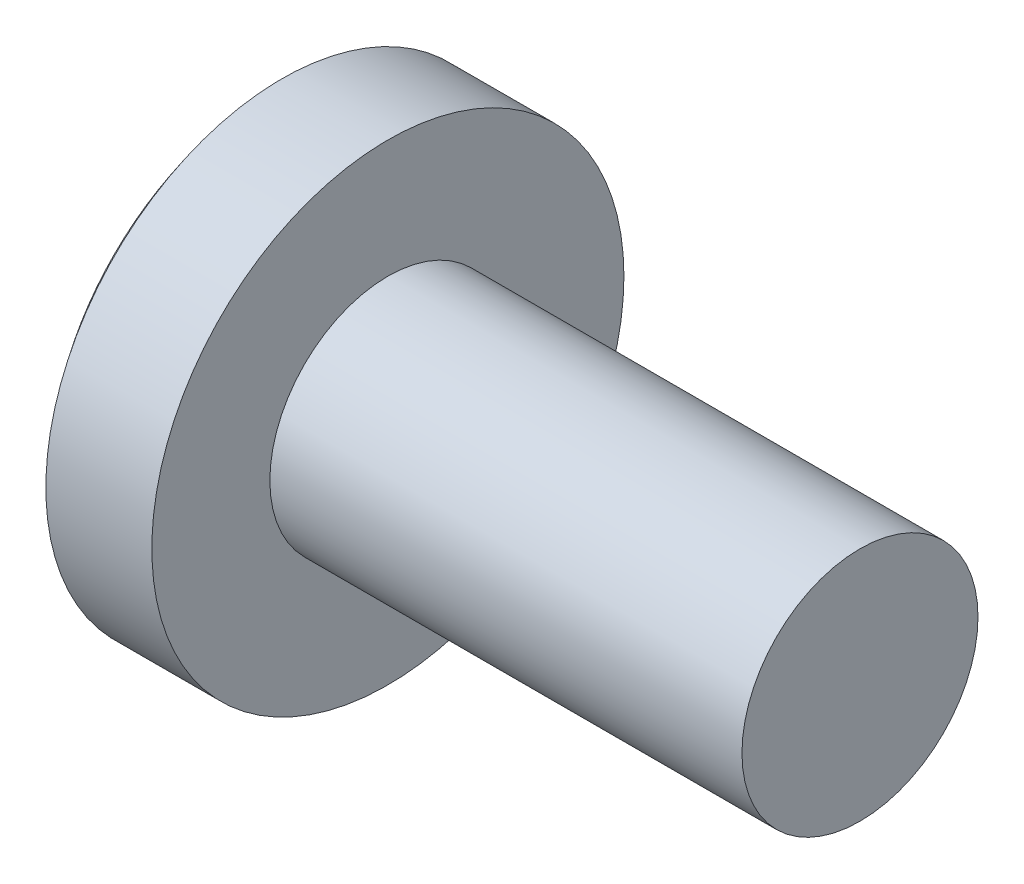
ISO-10303-21;
HEADER;
FILE_DESCRIPTION(('STEP AP214'),'2;1');
FILE_NAME('part.step','',(''),(''),'','','');
FILE_SCHEMA(('AUTOMOTIVE_DESIGN { 1 0 10303 214 1 1 1 1 }'));
ENDSEC;
DATA;
#1=APPLICATION_CONTEXT('core data for automotive mechanical design processes');
#2=APPLICATION_PROTOCOL_DEFINITION('international standard','automotive_design',2000,#1);
#3=PRODUCT_CONTEXT('',#1,'mechanical');
#4=PRODUCT('Part','Part','',(#3));
#5=PRODUCT_RELATED_PRODUCT_CATEGORY('part','',(#4));
#6=PRODUCT_DEFINITION_FORMATION('','',#4);
#7=PRODUCT_DEFINITION_CONTEXT('part definition',#1,'design');
#8=PRODUCT_DEFINITION('design','',#6,#7);
#9=PRODUCT_DEFINITION_SHAPE('','',#8);
#10=(LENGTH_UNIT() NAMED_UNIT(*) SI_UNIT(.MILLI.,.METRE.));
#11=(NAMED_UNIT(*) PLANE_ANGLE_UNIT() SI_UNIT($,.RADIAN.));
#12=(NAMED_UNIT(*) SI_UNIT($,.STERADIAN.) SOLID_ANGLE_UNIT());
#13=UNCERTAINTY_MEASURE_WITH_UNIT(LENGTH_MEASURE(1.E-05),#10,'distance_accuracy_value','');
#14=(GEOMETRIC_REPRESENTATION_CONTEXT(3) GLOBAL_UNCERTAINTY_ASSIGNED_CONTEXT((#13)) GLOBAL_UNIT_ASSIGNED_CONTEXT((#10,
#11,#12)) REPRESENTATION_CONTEXT('',''));
#15=CARTESIAN_POINT('',(0.,0.,0.));
#16=DIRECTION('',(0.,0.,1.));
#17=DIRECTION('',(1.,0.,0.));
#18=AXIS2_PLACEMENT_3D('',#15,#16,#17);
#19=CARTESIAN_POINT('',(3.2,0.,0.));
#20=DIRECTION('',(1.,0.,0.));
#21=DIRECTION('',(0.,1.,0.));
#22=AXIS2_PLACEMENT_3D('',#19,#20,#21);
#23=SPHERICAL_SURFACE('',#22,3.2);
#24=CARTESIAN_POINT('',(0.702000800640641,0.,0.));
#25=DIRECTION('',(1.,0.,0.));
#26=DIRECTION('',(0.,0.,-1.));
#27=AXIS2_PLACEMENT_3D('',#24,#25,#26);
#28=CIRCLE('',#27,2.);
#29=CARTESIAN_POINT('',(0.702000800640641,0.,-2.));
#30=VERTEX_POINT('',#29);
#31=EDGE_CURVE('E207',#30,#30,#28,.T.);
#32=ORIENTED_EDGE('',*,*,#31,.F.);
#33=EDGE_LOOP('',(#32));
#34=FACE_BOUND('',#33,.T.);
#35=CARTESIAN_POINT('',(3.2,-0.19,0.));
#36=DIRECTION('',(0.,1.,0.));
#37=DIRECTION('',(0.,0.,1.));
#38=AXIS2_PLACEMENT_3D('',#35,#36,#37);
#39=CIRCLE('',#38,3.19435439486604);
#40=CARTESIAN_POINT('',(0.128116518841083,-0.19,0.876031893359463));
#41=VERTEX_POINT('',#40);
#42=CARTESIAN_POINT('',(0.0434512517624576,-0.19,0.49));
#43=VERTEX_POINT('',#42);
#44=EDGE_CURVE('E141',#41,#43,#39,.F.);
#45=ORIENTED_EDGE('',*,*,#44,.T.);
#46=CARTESIAN_POINT('',(0.0434512517624571,-0.19,0.49));
#47=CARTESIAN_POINT('',(0.0408738773929442,-0.189985118490982,0.473411368352518));
#48=CARTESIAN_POINT('',(0.0385122737731477,-0.191375280547119,0.45678774580514));
#49=CARTESIAN_POINT('',(0.0342793774917009,-0.196894192604607,0.423939980878307));
#50=CARTESIAN_POINT('',(0.032408018098608,-0.201022569613025,0.407715784402144));
#51=CARTESIAN_POINT('',(0.0292120609216641,-0.2119518671846,0.376115889679846));
#52=CARTESIAN_POINT('',(0.0278880075495782,-0.218755435732716,0.360741049401918));
#53=CARTESIAN_POINT('',(0.0258300216333508,-0.234850871954501,0.331318538531042));
#54=CARTESIAN_POINT('',(0.0250958387239786,-0.244141681706182,0.317270307107504));
#55=CARTESIAN_POINT('',(0.0242453397312426,-0.264820786877322,0.291079740811089));
#56=CARTESIAN_POINT('',(0.0241213644300021,-0.276181215319777,0.27891564613864));
#57=CARTESIAN_POINT('',(0.0244743849819802,-0.300751739444164,0.256633055026912));
#58=CARTESIAN_POINT('',(0.0249514532038782,-0.313962057691943,0.246514805087926));
#59=CARTESIAN_POINT('',(0.0264873092406806,-0.341764748147378,0.22866155902565));
#60=CARTESIAN_POINT('',(0.0275427361860064,-0.356348736233031,0.220913192921297));
#61=CARTESIAN_POINT('',(0.0302016331156974,-0.386546091629585,0.207923367225205));
#62=CARTESIAN_POINT('',(0.0318049788587377,-0.402159224933208,0.202681339963669));
#63=CARTESIAN_POINT('',(0.0350324297399582,-0.429857047162115,0.195839033890913));
#64=CARTESIAN_POINT('',(0.036544485982116,-0.441812973684979,0.193648149789925));
#65=CARTESIAN_POINT('',(0.0398172259395469,-0.465850838778572,0.190728248289838));
#66=CARTESIAN_POINT('',(0.0415775491224674,-0.47793257149748,0.189997133951024));
#67=CARTESIAN_POINT('',(0.0434512517624571,-0.49,0.19));
#68=B_SPLINE_CURVE_WITH_KNOTS('',3,(#46,#47,#48,#49,#50,#51,#52,#53,#54,#55,#56,#57,#58,#59,#60,
#61,#62,#63,#64,#65,#66,#67),.UNSPECIFIED.,.F.,.F.,(4,2,2,2,2,2,2,2,2,2,4),(0.,
0.0503064187517198,0.100605986293286,0.150955467701085,0.201283567416481,0.250978317771728,
0.300679052198084,0.350093989724499,0.399497729773931,0.436157176931991,0.472763925288841),.UNSPECIFIED.);
#69=CARTESIAN_POINT('',(0.0434512517624576,-0.49,0.19));
#70=VERTEX_POINT('',#69);
#71=EDGE_CURVE('E126',#43,#70,#68,.T.);
#72=ORIENTED_EDGE('',*,*,#71,.T.);
#73=CARTESIAN_POINT('',(3.2,0.,0.19));
#74=DIRECTION('',(0.,0.,-1.));
#75=DIRECTION('',(0.,1.,0.));
#76=AXIS2_PLACEMENT_3D('',#73,#74,#75);
#77=CIRCLE('',#76,3.19435439486604);
#78=CARTESIAN_POINT('',(0.128116518841083,-0.876031893359463,0.19));
#79=VERTEX_POINT('',#78);
#80=EDGE_CURVE('E150',#70,#79,#77,.F.);
#81=ORIENTED_EDGE('',*,*,#80,.T.);
#82=CARTESIAN_POINT('',(2.81136206679761,0.673140646055104,0.));
#83=DIRECTION('',(-0.5,0.866025403784438,0.));
#84=DIRECTION('',(-0.866025403784438,-0.5,0.));
#85=AXIS2_PLACEMENT_3D('',#82,#83,#84);
#86=CIRCLE('',#85,3.10416530286399);
#87=CARTESIAN_POINT('',(0.128116518841083,-0.876031893359463,-0.19));
#88=VERTEX_POINT('',#87);
#89=EDGE_CURVE('E153',#79,#88,#86,.F.);
#90=ORIENTED_EDGE('',*,*,#89,.T.);
#91=CARTESIAN_POINT('',(3.2,0.,-0.19));
#92=DIRECTION('',(0.,0.,1.));
#93=DIRECTION('',(1.,0.,0.));
#94=AXIS2_PLACEMENT_3D('',#91,#92,#93);
#95=CIRCLE('',#94,3.19435439486604);
#96=CARTESIAN_POINT('',(0.0434512517624576,-0.49,-0.19));
#97=VERTEX_POINT('',#96);
#98=EDGE_CURVE('E160',#88,#97,#95,.F.);
#99=ORIENTED_EDGE('',*,*,#98,.T.);
#100=CARTESIAN_POINT('',(0.0434512517624571,-0.49,-0.19));
#101=CARTESIAN_POINT('',(0.0408738773929448,-0.473411368352518,-0.189985118490982));
#102=CARTESIAN_POINT('',(0.0385122737731485,-0.45678774580514,-0.191375280547119));
#103=CARTESIAN_POINT('',(0.0342793774917017,-0.423939980878307,-0.196894192604607));
#104=CARTESIAN_POINT('',(0.0324080180986087,-0.407715784402144,-0.201022569613025));
#105=CARTESIAN_POINT('',(0.0292120609216642,-0.376115889679846,-0.2119518671846));
#106=CARTESIAN_POINT('',(0.027888007549578,-0.360741049401919,-0.218755435732716));
#107=CARTESIAN_POINT('',(0.0258300216333505,-0.331318538531043,-0.234850871954501));
#108=CARTESIAN_POINT('',(0.0250958387239786,-0.317270307107504,-0.244141681706183));
#109=CARTESIAN_POINT('',(0.0242453397312427,-0.291079740811089,-0.264820786877322));
#110=CARTESIAN_POINT('',(0.0241213644300021,-0.27891564613864,-0.276181215319776));
#111=CARTESIAN_POINT('',(0.0244743849819801,-0.256633055026912,-0.300751739444164));
#112=CARTESIAN_POINT('',(0.0249514532038781,-0.246514805087926,-0.313962057691943));
#113=CARTESIAN_POINT('',(0.0264873092406806,-0.22866155902565,-0.341764748147379));
#114=CARTESIAN_POINT('',(0.0275427361860063,-0.220913192921297,-0.356348736233031));
#115=CARTESIAN_POINT('',(0.0302016331156974,-0.207923367225205,-0.386546091629585));
#116=CARTESIAN_POINT('',(0.0318049788587377,-0.20268133996367,-0.402159224933209));
#117=CARTESIAN_POINT('',(0.0350324297399583,-0.195839033890913,-0.429857047162115));
#118=CARTESIAN_POINT('',(0.0365444859821161,-0.193648149789925,-0.441812973684979));
#119=CARTESIAN_POINT('',(0.0398172259395469,-0.190728248289838,-0.465850838778572));
#120=CARTESIAN_POINT('',(0.0415775491224674,-0.189997133951024,-0.47793257149748));
#121=CARTESIAN_POINT('',(0.0434512517624571,-0.19,-0.49));
#122=B_SPLINE_CURVE_WITH_KNOTS('',3,(#100,#101,#102,#103,#104,#105,#106,#107,#108,#109,#110,
#111,#112,#113,#114,#115,#116,#117,#118,#119,#120,#121),.UNSPECIFIED.,.F.,.F.,(4,2,2,2,2,2,2,2,
2,2,4),(0.,0.0503064187517195,0.100605986293286,0.150955467701084,0.20128356741648,
0.250978317771727,0.300679052198084,0.350093989724499,0.399497729773931,0.43615717693199,
0.472763925288841),.UNSPECIFIED.);
#123=CARTESIAN_POINT('',(0.0434512517624576,-0.19,-0.49));
#124=VERTEX_POINT('',#123);
#125=EDGE_CURVE('E137',#97,#124,#122,.T.);
#126=ORIENTED_EDGE('',*,*,#125,.T.);
#127=CARTESIAN_POINT('',(3.2,-0.19,0.));
#128=DIRECTION('',(0.,1.,0.));
#129=DIRECTION('',(0.,0.,1.));
#130=AXIS2_PLACEMENT_3D('',#127,#128,#129);
#131=CIRCLE('',#130,3.19435439486604);
#132=CARTESIAN_POINT('',(0.128116518841083,-0.19,-0.876031893359463));
#133=VERTEX_POINT('',#132);
#134=EDGE_CURVE('E158',#124,#133,#131,.F.);
#135=ORIENTED_EDGE('',*,*,#134,.T.);
#136=CARTESIAN_POINT('',(2.81136206679761,0.,0.673140646055104));
#137=DIRECTION('',(-0.5,0.,0.866025403784438));
#138=DIRECTION('',(0.866025403784438,0.,0.5));
#139=AXIS2_PLACEMENT_3D('',#136,#137,#138);
#140=CIRCLE('',#139,3.10416530286399);
#141=CARTESIAN_POINT('',(0.128116518841083,0.19,-0.876031893359463));
#142=VERTEX_POINT('',#141);
#143=EDGE_CURVE('E161',#133,#142,#140,.F.);
#144=ORIENTED_EDGE('',*,*,#143,.T.);
#145=CARTESIAN_POINT('',(3.2,0.19,0.));
#146=DIRECTION('',(0.,-1.,0.));
#147=DIRECTION('',(0.,0.,-1.));
#148=AXIS2_PLACEMENT_3D('',#145,#146,#147);
#149=CIRCLE('',#148,3.19435439486604);
#150=CARTESIAN_POINT('',(0.0434512517624576,0.19,-0.49));
#151=VERTEX_POINT('',#150);
#152=EDGE_CURVE('E162',#142,#151,#149,.F.);
#153=ORIENTED_EDGE('',*,*,#152,.T.);
#154=CARTESIAN_POINT('',(0.0434512517624571,0.19,-0.49));
#155=CARTESIAN_POINT('',(0.0408738773929445,0.189985118490982,-0.473411368352518));
#156=CARTESIAN_POINT('',(0.0385122737731481,0.191375280547119,-0.45678774580514));
#157=CARTESIAN_POINT('',(0.0342793774917014,0.196894192604607,-0.423939980878307));
#158=CARTESIAN_POINT('',(0.0324080180986086,0.201022569613025,-0.407715784402144));
#159=CARTESIAN_POINT('',(0.0292120609216644,0.2119518671846,-0.376115889679846));
#160=CARTESIAN_POINT('',(0.0278880075495783,0.218755435732716,-0.360741049401919));
#161=CARTESIAN_POINT('',(0.0258300216333509,0.234850871954501,-0.331318538531043));
#162=CARTESIAN_POINT('',(0.0250958387239788,0.244141681706183,-0.317270307107504));
#163=CARTESIAN_POINT('',(0.0242453397312424,0.264820786877322,-0.291079740811089));
#164=CARTESIAN_POINT('',(0.0241213644300013,0.276181215319776,-0.27891564613864));
#165=CARTESIAN_POINT('',(0.0244743849819795,0.300751739444163,-0.256633055026913));
#166=CARTESIAN_POINT('',(0.0249514532038783,0.313962057691943,-0.246514805087926));
#167=CARTESIAN_POINT('',(0.0264873092406812,0.341764748147378,-0.22866155902565));
#168=CARTESIAN_POINT('',(0.0275427361860068,0.356348736233031,-0.220913192921297));
#169=CARTESIAN_POINT('',(0.0302016331156974,0.386546091629584,-0.207923367225206));
#170=CARTESIAN_POINT('',(0.0318049788587374,0.402159224933208,-0.202681339963671));
#171=CARTESIAN_POINT('',(0.0350324297399584,0.429857047162115,-0.195839033890914));
#172=CARTESIAN_POINT('',(0.0365444859821166,0.441812973684979,-0.193648149789926));
#173=CARTESIAN_POINT('',(0.0398172259395477,0.465850838778572,-0.190728248289838));
#174=CARTESIAN_POINT('',(0.0415775491224682,0.47793257149748,-0.189997133951023));
#175=CARTESIAN_POINT('',(0.0434512517624571,0.49,-0.19));
#176=B_SPLINE_CURVE_WITH_KNOTS('',3,(#154,#155,#156,#157,#158,#159,#160,#161,#162,#163,#164,
#165,#166,#167,#168,#169,#170,#171,#172,#173,#174,#175),.UNSPECIFIED.,.F.,.F.,(4,2,2,2,2,2,2,2,
2,2,4),(0.,0.0503064187517195,0.100605986293286,0.150955467701084,0.20128356741648,
0.250978317771727,0.300679052198084,0.350093989724498,0.39949772977393,0.43615717693199,
0.472763925288841),.UNSPECIFIED.);
#177=CARTESIAN_POINT('',(0.0434512517624576,0.49,-0.19));
#178=VERTEX_POINT('',#177);
#179=EDGE_CURVE('E144',#151,#178,#176,.T.);
#180=ORIENTED_EDGE('',*,*,#179,.T.);
#181=CARTESIAN_POINT('',(3.2,0.,-0.19));
#182=DIRECTION('',(0.,0.,1.));
#183=DIRECTION('',(1.,0.,0.));
#184=AXIS2_PLACEMENT_3D('',#181,#182,#183);
#185=CIRCLE('',#184,3.19435439486604);
#186=CARTESIAN_POINT('',(0.128116518841082,0.876031893359464,-0.19));
#187=VERTEX_POINT('',#186);
#188=EDGE_CURVE('E165',#178,#187,#185,.F.);
#189=ORIENTED_EDGE('',*,*,#188,.T.);
#190=CARTESIAN_POINT('',(2.81136206679761,-0.673140646055104,0.));
#191=DIRECTION('',(-0.5,-0.866025403784438,0.));
#192=DIRECTION('',(0.866025403784438,-0.5,0.));
#193=AXIS2_PLACEMENT_3D('',#190,#191,#192);
#194=CIRCLE('',#193,3.10416530286399);
#195=CARTESIAN_POINT('',(0.128116518841082,0.876031893359464,0.19));
#196=VERTEX_POINT('',#195);
#197=EDGE_CURVE('E191',#187,#196,#194,.F.);
#198=ORIENTED_EDGE('',*,*,#197,.T.);
#199=CARTESIAN_POINT('',(3.2,0.,0.19));
#200=DIRECTION('',(0.,0.,-1.));
#201=DIRECTION('',(0.,1.,0.));
#202=AXIS2_PLACEMENT_3D('',#199,#200,#201);
#203=CIRCLE('',#202,3.19435439486604);
#204=CARTESIAN_POINT('',(0.0434512517624576,0.49,0.19));
#205=VERTEX_POINT('',#204);
#206=EDGE_CURVE('E194',#196,#205,#203,.F.);
#207=ORIENTED_EDGE('',*,*,#206,.T.);
#208=CARTESIAN_POINT('',(0.0434512517624571,0.49,0.19));
#209=CARTESIAN_POINT('',(0.0408738773929445,0.473411368352519,0.189985118490982));
#210=CARTESIAN_POINT('',(0.0385122737731482,0.45678774580514,0.191375280547119));
#211=CARTESIAN_POINT('',(0.0342793774917014,0.423939980878307,0.196894192604606));
#212=CARTESIAN_POINT('',(0.0324080180986085,0.407715784402144,0.201022569613024));
#213=CARTESIAN_POINT('',(0.0292120609216644,0.376115889679846,0.211951867184599));
#214=CARTESIAN_POINT('',(0.0278880075495784,0.360741049401919,0.218755435732716));
#215=CARTESIAN_POINT('',(0.0258300216333509,0.331318538531043,0.234850871954501));
#216=CARTESIAN_POINT('',(0.0250958387239788,0.317270307107504,0.244141681706182));
#217=CARTESIAN_POINT('',(0.0242453397312424,0.291079740811089,0.264820786877322));
#218=CARTESIAN_POINT('',(0.0241213644300013,0.278915646138641,0.276181215319776));
#219=CARTESIAN_POINT('',(0.0244743849819796,0.256633055026913,0.300751739444163));
#220=CARTESIAN_POINT('',(0.0249514532038783,0.246514805087926,0.313962057691943));
#221=CARTESIAN_POINT('',(0.0264873092406812,0.22866155902565,0.341764748147378));
#222=CARTESIAN_POINT('',(0.0275427361860068,0.220913192921297,0.356348736233031));
#223=CARTESIAN_POINT('',(0.0302016331156974,0.207923367225206,0.386546091629584));
#224=CARTESIAN_POINT('',(0.0318049788587374,0.20268133996367,0.402159224933208));
#225=CARTESIAN_POINT('',(0.0350324297399583,0.195839033890913,0.429857047162115));
#226=CARTESIAN_POINT('',(0.0365444859821165,0.193648149789925,0.441812973684979));
#227=CARTESIAN_POINT('',(0.0398172259395477,0.190728248289838,0.465850838778572));
#228=CARTESIAN_POINT('',(0.0415775491224682,0.189997133951024,0.47793257149748));
#229=CARTESIAN_POINT('',(0.043451251762457,0.19,0.49));
#230=B_SPLINE_CURVE_WITH_KNOTS('',3,(#208,#209,#210,#211,#212,#213,#214,#215,#216,#217,#218,
#219,#220,#221,#222,#223,#224,#225,#226,#227,#228,#229),.UNSPECIFIED.,.F.,.F.,(4,2,2,2,2,2,2,2,
2,2,4),(0.,0.0503064187517195,0.100605986293286,0.150955467701084,0.20128356741648,
0.250978317771727,0.300679052198084,0.350093989724499,0.39949772977393,0.43615717693199,
0.472763925288841),.UNSPECIFIED.);
#231=CARTESIAN_POINT('',(0.0434512517624576,0.19,0.49));
#232=VERTEX_POINT('',#231);
#233=EDGE_CURVE('E264',#205,#232,#230,.T.);
#234=ORIENTED_EDGE('',*,*,#233,.T.);
#235=CARTESIAN_POINT('',(3.2,0.19,0.));
#236=DIRECTION('',(0.,-1.,0.));
#237=DIRECTION('',(0.,0.,-1.));
#238=AXIS2_PLACEMENT_3D('',#235,#236,#237);
#239=CIRCLE('',#238,3.19435439486604);
#240=CARTESIAN_POINT('',(0.128116518841083,0.19,0.876031893359463));
#241=VERTEX_POINT('',#240);
#242=EDGE_CURVE('E145',#232,#241,#239,.F.);
#243=ORIENTED_EDGE('',*,*,#242,.T.);
#244=CARTESIAN_POINT('',(2.81136206679761,0.,-0.673140646055104));
#245=DIRECTION('',(-0.5,0.,-0.866025403784438));
#246=DIRECTION('',(-0.866025403784438,0.,0.5));
#247=AXIS2_PLACEMENT_3D('',#244,#245,#246);
#248=CIRCLE('',#247,3.10416530286399);
#249=EDGE_CURVE('E149',#241,#41,#248,.F.);
#250=ORIENTED_EDGE('',*,*,#249,.T.);
#251=EDGE_LOOP('',(#45,#72,#81,#90,#99,#126,#135,#144,#153,#180,#189,#198,#207,#234,#243,#250));
#252=FACE_BOUND('',#251,.T.);
#253=ADVANCED_FACE('F16',(#34,#252),#23,.T.);
#254=CARTESIAN_POINT('',(5.6,1.,0.));
#255=DIRECTION('',(1.,0.,0.));
#256=DIRECTION('',(0.,0.,-1.));
#257=AXIS2_PLACEMENT_3D('',#254,#255,#256);
#258=PLANE('',#257);
#259=CARTESIAN_POINT('',(5.6,0.,0.));
#260=DIRECTION('',(1.,0.,0.));
#261=DIRECTION('',(0.,0.,-1.));
#262=AXIS2_PLACEMENT_3D('',#259,#260,#261);
#263=CIRCLE('',#262,1.);
#264=CARTESIAN_POINT('',(5.6,0.,-1.));
#265=VERTEX_POINT('',#264);
#266=EDGE_CURVE('E246',#265,#265,#263,.T.);
#267=ORIENTED_EDGE('',*,*,#266,.T.);
#268=EDGE_LOOP('',(#267));
#269=FACE_BOUND('',#268,.T.);
#270=ADVANCED_FACE('F304',(#269),#258,.T.);
#271=CARTESIAN_POINT('',(4.51581291088132,0.,0.));
#272=DIRECTION('',(1.,0.,0.));
#273=DIRECTION('',(0.,0.,-1.));
#274=AXIS2_PLACEMENT_3D('',#271,#272,#273);
#275=CYLINDRICAL_SURFACE('',#274,1.);
#276=CARTESIAN_POINT('',(1.6,0.,0.));
#277=DIRECTION('',(1.,0.,0.));
#278=DIRECTION('',(0.,0.,-1.));
#279=AXIS2_PLACEMENT_3D('',#276,#277,#278);
#280=CIRCLE('',#279,1.);
#281=CARTESIAN_POINT('',(1.6,0.,-1.));
#282=VERTEX_POINT('',#281);
#283=EDGE_CURVE('E248',#282,#282,#280,.T.);
#284=ORIENTED_EDGE('',*,*,#283,.T.);
#285=EDGE_LOOP('',(#284));
#286=FACE_BOUND('',#285,.T.);
#287=ORIENTED_EDGE('',*,*,#266,.F.);
#288=EDGE_LOOP('',(#287));
#289=FACE_BOUND('',#288,.T.);
#290=ADVANCED_FACE('F310',(#286,#289),#275,.T.);
#291=CARTESIAN_POINT('',(1.6,1.3,0.));
#292=DIRECTION('',(1.,0.,0.));
#293=DIRECTION('',(0.,0.,-1.));
#294=AXIS2_PLACEMENT_3D('',#291,#292,#293);
#295=PLANE('',#294);
#296=CARTESIAN_POINT('',(1.6,0.,0.));
#297=DIRECTION('',(1.,0.,0.));
#298=DIRECTION('',(0.,0.,-1.));
#299=AXIS2_PLACEMENT_3D('',#296,#297,#298);
#300=CIRCLE('',#299,2.);
#301=CARTESIAN_POINT('',(1.6,0.,-2.));
#302=VERTEX_POINT('',#301);
#303=EDGE_CURVE('E253',#302,#302,#300,.T.);
#304=ORIENTED_EDGE('',*,*,#303,.T.);
#305=EDGE_LOOP('',(#304));
#306=FACE_BOUND('',#305,.T.);
#307=ORIENTED_EDGE('',*,*,#283,.F.);
#308=EDGE_LOOP('',(#307));
#309=FACE_BOUND('',#308,.T.);
#310=ADVANCED_FACE('F319',(#306,#309),#295,.T.);
#311=CARTESIAN_POINT('',(4.51581291088132,0.,0.));
#312=DIRECTION('',(1.,0.,0.));
#313=DIRECTION('',(0.,0.,-1.));
#314=AXIS2_PLACEMENT_3D('',#311,#312,#313);
#315=CYLINDRICAL_SURFACE('',#314,2.);
#316=ORIENTED_EDGE('',*,*,#31,.T.);
#317=EDGE_LOOP('',(#316));
#318=FACE_BOUND('',#317,.T.);
#319=ORIENTED_EDGE('',*,*,#303,.F.);
#320=EDGE_LOOP('',(#319));
#321=FACE_BOUND('',#320,.T.);
#322=ADVANCED_FACE('F300',(#318,#321),#315,.T.);
#323=CARTESIAN_POINT('',(1.12,0.19,0.19));
#324=DIRECTION('',(0.,-1.,0.));
#325=DIRECTION('',(0.,0.,-1.));
#326=AXIS2_PLACEMENT_3D('',#323,#324,#325);
#327=PLANE('',#326);
#328=ORIENTED_EDGE('',*,*,#242,.F.);
#329=DIRECTION('',(-1.,0.,0.));
#330=VECTOR('',#329,1.);
#331=CARTESIAN_POINT('',(1.12,0.19,0.49));
#332=LINE('',#331,#330);
#333=CARTESIAN_POINT('',(0.796743371481682,0.19,0.49));
#334=VERTEX_POINT('',#333);
#335=EDGE_CURVE('E355',#232,#334,#332,.F.);
#336=ORIENTED_EDGE('',*,*,#335,.T.);
#337=DIRECTION('',(-0.866025403784438,0.,0.5));
#338=VECTOR('',#337,1.);
#339=CARTESIAN_POINT('',(0.,0.19,0.95));
#340=LINE('',#339,#338);
#341=EDGE_CURVE('E205',#334,#241,#340,.T.);
#342=ORIENTED_EDGE('',*,*,#341,.T.);
#343=EDGE_LOOP('',(#328,#336,#342));
#344=FACE_BOUND('',#343,.T.);
#345=ADVANCED_FACE('F291',(#344),#327,.T.);
#346=CARTESIAN_POINT('',(0.,0.,0.95));
#347=DIRECTION('',(-0.5,0.,-0.866025403784438));
#348=DIRECTION('',(-0.866025403784438,0.,0.5));
#349=AXIS2_PLACEMENT_3D('',#346,#347,#348);
#350=PLANE('',#349);
#351=ORIENTED_EDGE('',*,*,#341,.F.);
#352=CARTESIAN_POINT('',(0.796743371481682,0.49,0.49));
#353=DIRECTION('',(-0.5,0.,-0.866025403784438));
#354=DIRECTION('',(-0.866025403784438,0.,0.5));
#355=AXIS2_PLACEMENT_3D('',#352,#353,#354);
#356=ELLIPSE('',#355,0.6,0.3);
#357=CARTESIAN_POINT('',(1.12,0.255120490379309,0.303367698507617));
#358=VERTEX_POINT('',#357);
#359=EDGE_CURVE('E212',#334,#358,#356,.F.);
#360=ORIENTED_EDGE('',*,*,#359,.T.);
#361=DIRECTION('',(0.,-1.,0.));
#362=VECTOR('',#361,1.);
#363=CARTESIAN_POINT('',(1.12,0.,0.303367698507617));
#364=LINE('',#363,#362);
#365=CARTESIAN_POINT('',(1.12,-0.255120490379308,0.303367698507617));
#366=VERTEX_POINT('',#365);
#367=EDGE_CURVE('E178',#358,#366,#364,.T.);
#368=ORIENTED_EDGE('',*,*,#367,.T.);
#369=CARTESIAN_POINT('',(0.796743371481683,-0.49,0.49));
#370=DIRECTION('',(-0.5,0.,-0.866025403784438));
#371=DIRECTION('',(-0.866025403784438,0.,0.5));
#372=AXIS2_PLACEMENT_3D('',#369,#370,#371);
#373=ELLIPSE('',#372,0.6,0.3);
#374=CARTESIAN_POINT('',(0.796743371481683,-0.19,0.49));
#375=VERTEX_POINT('',#374);
#376=EDGE_CURVE('E204',#375,#366,#373,.T.);
#377=ORIENTED_EDGE('',*,*,#376,.F.);
#378=DIRECTION('',(-0.866025403784438,0.,0.5));
#379=VECTOR('',#378,1.);
#380=CARTESIAN_POINT('',(1.16908965343809,-0.19,0.275025773880713));
#381=LINE('',#380,#379);
#382=EDGE_CURVE('E143',#375,#41,#381,.T.);
#383=ORIENTED_EDGE('',*,*,#382,.T.);
#384=ORIENTED_EDGE('',*,*,#249,.F.);
#385=EDGE_LOOP('',(#351,#360,#368,#377,#383,#384));
#386=FACE_BOUND('',#385,.T.);
#387=ADVANCED_FACE('F289',(#386),#350,.T.);
#388=CARTESIAN_POINT('',(1.12,-0.19,0.19));
#389=DIRECTION('',(0.,1.,0.));
#390=DIRECTION('',(0.,0.,1.));
#391=AXIS2_PLACEMENT_3D('',#388,#389,#390);
#392=PLANE('',#391);
#393=ORIENTED_EDGE('',*,*,#382,.F.);
#394=DIRECTION('',(-1.,0.,0.));
#395=VECTOR('',#394,1.);
#396=CARTESIAN_POINT('',(1.12,-0.19,0.49));
#397=LINE('',#396,#395);
#398=EDGE_CURVE('E130',#375,#43,#397,.T.);
#399=ORIENTED_EDGE('',*,*,#398,.T.);
#400=ORIENTED_EDGE('',*,*,#44,.F.);
#401=EDGE_LOOP('',(#393,#399,#400));
#402=FACE_BOUND('',#401,.T.);
#403=ADVANCED_FACE('F140',(#402),#392,.T.);
#404=CARTESIAN_POINT('',(1.12,-0.19,0.19));
#405=DIRECTION('',(0.,0.,-1.));
#406=DIRECTION('',(0.,1.,0.));
#407=AXIS2_PLACEMENT_3D('',#404,#405,#406);
#408=PLANE('',#407);
#409=ORIENTED_EDGE('',*,*,#80,.F.);
#410=DIRECTION('',(-1.,0.,0.));
#411=VECTOR('',#410,1.);
#412=CARTESIAN_POINT('',(1.12,-0.49,0.19));
#413=LINE('',#412,#411);
#414=CARTESIAN_POINT('',(0.796743371481682,-0.49,0.19));
#415=VERTEX_POINT('',#414);
#416=EDGE_CURVE('E133',#70,#415,#413,.F.);
#417=ORIENTED_EDGE('',*,*,#416,.T.);
#418=DIRECTION('',(-0.866025403784438,-0.5,0.));
#419=VECTOR('',#418,1.);
#420=CARTESIAN_POINT('',(0.,-0.95,0.19));
#421=LINE('',#420,#419);
#422=EDGE_CURVE('E166',#415,#79,#421,.T.);
#423=ORIENTED_EDGE('',*,*,#422,.T.);
#424=EDGE_LOOP('',(#409,#417,#423));
#425=FACE_BOUND('',#424,.T.);
#426=ADVANCED_FACE('F284',(#425),#408,.T.);
#427=CARTESIAN_POINT('',(0.,-0.95,0.));
#428=DIRECTION('',(-0.5,0.866025403784438,0.));
#429=DIRECTION('',(-0.866025403784438,-0.5,0.));
#430=AXIS2_PLACEMENT_3D('',#427,#428,#429);
#431=PLANE('',#430);
#432=ORIENTED_EDGE('',*,*,#422,.F.);
#433=CARTESIAN_POINT('',(0.796743371481682,-0.49,0.49));
#434=DIRECTION('',(-0.5,0.866025403784438,0.));
#435=DIRECTION('',(-0.866025403784438,-0.5,0.));
#436=AXIS2_PLACEMENT_3D('',#433,#434,#435);
#437=ELLIPSE('',#436,0.6,0.3);
#438=CARTESIAN_POINT('',(1.12,-0.303367698507617,0.255120490379308));
#439=VERTEX_POINT('',#438);
#440=EDGE_CURVE('E181',#415,#439,#437,.F.);
#441=ORIENTED_EDGE('',*,*,#440,.T.);
#442=DIRECTION('',(0.,0.,-1.));
#443=VECTOR('',#442,1.);
#444=CARTESIAN_POINT('',(1.12,-0.303367698507617,0.));
#445=LINE('',#444,#443);
#446=CARTESIAN_POINT('',(1.12,-0.303367698507617,-0.255120490379309));
#447=VERTEX_POINT('',#446);
#448=EDGE_CURVE('E175',#439,#447,#445,.T.);
#449=ORIENTED_EDGE('',*,*,#448,.T.);
#450=CARTESIAN_POINT('',(0.796743371481682,-0.49,-0.49));
#451=DIRECTION('',(-0.5,0.866025403784438,0.));
#452=DIRECTION('',(-0.866025403784438,-0.5,0.));
#453=AXIS2_PLACEMENT_3D('',#450,#451,#452);
#454=ELLIPSE('',#453,0.6,0.3);
#455=CARTESIAN_POINT('',(0.796743371481682,-0.49,-0.19));
#456=VERTEX_POINT('',#455);
#457=EDGE_CURVE('E179',#456,#447,#454,.T.);
#458=ORIENTED_EDGE('',*,*,#457,.F.);
#459=DIRECTION('',(-0.866025403784438,-0.5,0.));
#460=VECTOR('',#459,1.);
#461=CARTESIAN_POINT('',(1.16908965343809,-0.275025773880713,-0.19));
#462=LINE('',#461,#460);
#463=EDGE_CURVE('E169',#456,#88,#462,.T.);
#464=ORIENTED_EDGE('',*,*,#463,.T.);
#465=ORIENTED_EDGE('',*,*,#89,.F.);
#466=EDGE_LOOP('',(#432,#441,#449,#458,#464,#465));
#467=FACE_BOUND('',#466,.T.);
#468=ADVANCED_FACE('F280',(#467),#431,.T.);
#469=CARTESIAN_POINT('',(1.12,-0.19,-0.19));
#470=DIRECTION('',(0.,0.,1.));
#471=DIRECTION('',(1.,0.,0.));
#472=AXIS2_PLACEMENT_3D('',#469,#470,#471);
#473=PLANE('',#472);
#474=ORIENTED_EDGE('',*,*,#463,.F.);
#475=DIRECTION('',(-1.,0.,0.));
#476=VECTOR('',#475,1.);
#477=CARTESIAN_POINT('',(1.12,-0.49,-0.19));
#478=LINE('',#477,#476);
#479=EDGE_CURVE('E346',#456,#97,#478,.T.);
#480=ORIENTED_EDGE('',*,*,#479,.T.);
#481=ORIENTED_EDGE('',*,*,#98,.F.);
#482=EDGE_LOOP('',(#474,#480,#481));
#483=FACE_BOUND('',#482,.T.);
#484=ADVANCED_FACE('F283',(#483),#473,.T.);
#485=CARTESIAN_POINT('',(1.12,-0.19,-0.19));
#486=DIRECTION('',(0.,1.,0.));
#487=DIRECTION('',(0.,0.,1.));
#488=AXIS2_PLACEMENT_3D('',#485,#486,#487);
#489=PLANE('',#488);
#490=ORIENTED_EDGE('',*,*,#134,.F.);
#491=DIRECTION('',(-1.,0.,0.));
#492=VECTOR('',#491,1.);
#493=CARTESIAN_POINT('',(1.12,-0.19,-0.49));
#494=LINE('',#493,#492);
#495=CARTESIAN_POINT('',(0.796743371481682,-0.19,-0.49));
#496=VERTEX_POINT('',#495);
#497=EDGE_CURVE('E349',#124,#496,#494,.F.);
#498=ORIENTED_EDGE('',*,*,#497,.T.);
#499=DIRECTION('',(-0.866025403784438,0.,-0.5));
#500=VECTOR('',#499,1.);
#501=CARTESIAN_POINT('',(0.,-0.19,-0.95));
#502=LINE('',#501,#500);
#503=EDGE_CURVE('E174',#496,#133,#502,.T.);
#504=ORIENTED_EDGE('',*,*,#503,.T.);
#505=EDGE_LOOP('',(#490,#498,#504));
#506=FACE_BOUND('',#505,.T.);
#507=ADVANCED_FACE('F288',(#506),#489,.T.);
#508=CARTESIAN_POINT('',(0.,0.,-0.95));
#509=DIRECTION('',(-0.5,0.,0.866025403784438));
#510=DIRECTION('',(0.866025403784438,0.,0.5));
#511=AXIS2_PLACEMENT_3D('',#508,#509,#510);
#512=PLANE('',#511);
#513=ORIENTED_EDGE('',*,*,#503,.F.);
#514=CARTESIAN_POINT('',(0.796743371481682,-0.49,-0.49));
#515=DIRECTION('',(-0.5,0.,0.866025403784438));
#516=DIRECTION('',(-0.866025403784438,0.,-0.5));
#517=AXIS2_PLACEMENT_3D('',#514,#515,#516);
#518=ELLIPSE('',#517,0.6,0.3);
#519=CARTESIAN_POINT('',(1.12,-0.255120490379309,-0.303367698507617));
#520=VERTEX_POINT('',#519);
#521=EDGE_CURVE('E11',#496,#520,#518,.F.);
#522=ORIENTED_EDGE('',*,*,#521,.T.);
#523=DIRECTION('',(0.,1.,0.));
#524=VECTOR('',#523,1.);
#525=CARTESIAN_POINT('',(1.12,0.,-0.303367698507617));
#526=LINE('',#525,#524);
#527=CARTESIAN_POINT('',(1.12,0.255120490379309,-0.303367698507617));
#528=VERTEX_POINT('',#527);
#529=EDGE_CURVE('E177',#520,#528,#526,.T.);
#530=ORIENTED_EDGE('',*,*,#529,.T.);
#531=CARTESIAN_POINT('',(0.796743371481682,0.49,-0.49));
#532=DIRECTION('',(-0.5,0.,0.866025403784438));
#533=DIRECTION('',(-0.866025403784438,0.,-0.5));
#534=AXIS2_PLACEMENT_3D('',#531,#532,#533);
#535=ELLIPSE('',#534,0.6,0.3);
#536=CARTESIAN_POINT('',(0.796743371481682,0.19,-0.49));
#537=VERTEX_POINT('',#536);
#538=EDGE_CURVE('E25',#537,#528,#535,.T.);
#539=ORIENTED_EDGE('',*,*,#538,.F.);
#540=DIRECTION('',(-0.866025403784438,0.,-0.5));
#541=VECTOR('',#540,1.);
#542=CARTESIAN_POINT('',(1.16908965343809,0.19,-0.275025773880713));
#543=LINE('',#542,#541);
#544=EDGE_CURVE('E189',#537,#142,#543,.T.);
#545=ORIENTED_EDGE('',*,*,#544,.T.);
#546=ORIENTED_EDGE('',*,*,#143,.F.);
#547=EDGE_LOOP('',(#513,#522,#530,#539,#545,#546));
#548=FACE_BOUND('',#547,.T.);
#549=ADVANCED_FACE('F232',(#548),#512,.T.);
#550=CARTESIAN_POINT('',(1.12,0.19,-0.19));
#551=DIRECTION('',(0.,-1.,0.));
#552=DIRECTION('',(0.,0.,-1.));
#553=AXIS2_PLACEMENT_3D('',#550,#551,#552);
#554=PLANE('',#553);
#555=ORIENTED_EDGE('',*,*,#544,.F.);
#556=DIRECTION('',(-1.,0.,0.));
#557=VECTOR('',#556,1.);
#558=CARTESIAN_POINT('',(1.12,0.19,-0.49));
#559=LINE('',#558,#557);
#560=EDGE_CURVE('E228',#537,#151,#559,.T.);
#561=ORIENTED_EDGE('',*,*,#560,.T.);
#562=ORIENTED_EDGE('',*,*,#152,.F.);
#563=EDGE_LOOP('',(#555,#561,#562));
#564=FACE_BOUND('',#563,.T.);
#565=ADVANCED_FACE('F287',(#564),#554,.T.);
#566=CARTESIAN_POINT('',(1.12,0.19,-0.19));
#567=DIRECTION('',(0.,0.,1.));
#568=DIRECTION('',(1.,0.,0.));
#569=AXIS2_PLACEMENT_3D('',#566,#567,#568);
#570=PLANE('',#569);
#571=ORIENTED_EDGE('',*,*,#188,.F.);
#572=DIRECTION('',(-1.,0.,0.));
#573=VECTOR('',#572,1.);
#574=CARTESIAN_POINT('',(1.12,0.49,-0.19));
#575=LINE('',#574,#573);
#576=CARTESIAN_POINT('',(0.796743371481682,0.49,-0.19));
#577=VERTEX_POINT('',#576);
#578=EDGE_CURVE('E359',#178,#577,#575,.F.);
#579=ORIENTED_EDGE('',*,*,#578,.T.);
#580=DIRECTION('',(-0.866025403784438,0.5,0.));
#581=VECTOR('',#580,1.);
#582=CARTESIAN_POINT('',(0.,0.95,-0.19));
#583=LINE('',#582,#581);
#584=EDGE_CURVE('E186',#577,#187,#583,.T.);
#585=ORIENTED_EDGE('',*,*,#584,.T.);
#586=EDGE_LOOP('',(#571,#579,#585));
#587=FACE_BOUND('',#586,.T.);
#588=ADVANCED_FACE('F379',(#587),#570,.T.);
#589=CARTESIAN_POINT('',(0.,0.95,0.));
#590=DIRECTION('',(-0.5,-0.866025403784438,0.));
#591=DIRECTION('',(0.866025403784438,-0.5,0.));
#592=AXIS2_PLACEMENT_3D('',#589,#590,#591);
#593=PLANE('',#592);
#594=ORIENTED_EDGE('',*,*,#584,.F.);
#595=CARTESIAN_POINT('',(0.796743371481682,0.49,-0.49));
#596=DIRECTION('',(-0.5,-0.866025403784438,0.));
#597=DIRECTION('',(-0.866025403784438,0.5,0.));
#598=AXIS2_PLACEMENT_3D('',#595,#596,#597);
#599=ELLIPSE('',#598,0.6,0.3);
#600=CARTESIAN_POINT('',(1.12,0.303367698507617,-0.255120490379309));
#601=VERTEX_POINT('',#600);
#602=EDGE_CURVE('E201',#577,#601,#599,.F.);
#603=ORIENTED_EDGE('',*,*,#602,.T.);
#604=DIRECTION('',(0.,0.,1.));
#605=VECTOR('',#604,1.);
#606=CARTESIAN_POINT('',(1.12,0.303367698507617,0.));
#607=LINE('',#606,#605);
#608=CARTESIAN_POINT('',(1.12,0.303367698507617,0.255120490379309));
#609=VERTEX_POINT('',#608);
#610=EDGE_CURVE('E197',#601,#609,#607,.T.);
#611=ORIENTED_EDGE('',*,*,#610,.T.);
#612=CARTESIAN_POINT('',(0.796743371481682,0.49,0.49));
#613=DIRECTION('',(-0.5,-0.866025403784438,0.));
#614=DIRECTION('',(-0.866025403784438,0.5,0.));
#615=AXIS2_PLACEMENT_3D('',#612,#613,#614);
#616=ELLIPSE('',#615,0.6,0.3);
#617=CARTESIAN_POINT('',(0.796743371481682,0.49,0.19));
#618=VERTEX_POINT('',#617);
#619=EDGE_CURVE('E185',#618,#609,#616,.T.);
#620=ORIENTED_EDGE('',*,*,#619,.F.);
#621=DIRECTION('',(-0.866025403784438,0.5,0.));
#622=VECTOR('',#621,1.);
#623=CARTESIAN_POINT('',(1.16908965343809,0.275025773880713,0.19));
#624=LINE('',#623,#622);
#625=EDGE_CURVE('E190',#618,#196,#624,.T.);
#626=ORIENTED_EDGE('',*,*,#625,.T.);
#627=ORIENTED_EDGE('',*,*,#197,.F.);
#628=EDGE_LOOP('',(#594,#603,#611,#620,#626,#627));
#629=FACE_BOUND('',#628,.T.);
#630=ADVANCED_FACE('F18',(#629),#593,.T.);
#631=CARTESIAN_POINT('',(1.12,0.19,0.19));
#632=DIRECTION('',(0.,0.,-1.));
#633=DIRECTION('',(0.,1.,0.));
#634=AXIS2_PLACEMENT_3D('',#631,#632,#633);
#635=PLANE('',#634);
#636=ORIENTED_EDGE('',*,*,#625,.F.);
#637=DIRECTION('',(-1.,0.,0.));
#638=VECTOR('',#637,1.);
#639=CARTESIAN_POINT('',(1.12,0.49,0.19));
#640=LINE('',#639,#638);
#641=EDGE_CURVE('E352',#618,#205,#640,.T.);
#642=ORIENTED_EDGE('',*,*,#641,.T.);
#643=ORIENTED_EDGE('',*,*,#206,.F.);
#644=EDGE_LOOP('',(#636,#642,#643));
#645=FACE_BOUND('',#644,.T.);
#646=ADVANCED_FACE('F405',(#645),#635,.T.);
#647=CARTESIAN_POINT('',(1.12,0.19,0.19));
#648=DIRECTION('',(1.,0.,0.));
#649=DIRECTION('',(0.,0.,-1.));
#650=AXIS2_PLACEMENT_3D('',#647,#648,#649);
#651=PLANE('',#650);
#652=ORIENTED_EDGE('',*,*,#367,.F.);
#653=CARTESIAN_POINT('',(1.12,0.49,0.49));
#654=DIRECTION('',(1.,0.,0.));
#655=DIRECTION('',(0.,0.,-1.));
#656=AXIS2_PLACEMENT_3D('',#653,#654,#655);
#657=CIRCLE('',#656,0.3);
#658=EDGE_CURVE('E238',#358,#609,#657,.T.);
#659=ORIENTED_EDGE('',*,*,#658,.T.);
#660=ORIENTED_EDGE('',*,*,#610,.F.);
#661=CARTESIAN_POINT('',(1.12,0.49,-0.49));
#662=DIRECTION('',(1.,0.,0.));
#663=DIRECTION('',(0.,0.,-1.));
#664=AXIS2_PLACEMENT_3D('',#661,#662,#663);
#665=CIRCLE('',#664,0.3);
#666=EDGE_CURVE('E182',#601,#528,#665,.T.);
#667=ORIENTED_EDGE('',*,*,#666,.T.);
#668=ORIENTED_EDGE('',*,*,#529,.F.);
#669=CARTESIAN_POINT('',(1.12,-0.49,-0.49));
#670=DIRECTION('',(1.,0.,0.));
#671=DIRECTION('',(0.,0.,-1.));
#672=AXIS2_PLACEMENT_3D('',#669,#670,#671);
#673=CIRCLE('',#672,0.3);
#674=EDGE_CURVE('E33',#520,#447,#673,.T.);
#675=ORIENTED_EDGE('',*,*,#674,.T.);
#676=ORIENTED_EDGE('',*,*,#448,.F.);
#677=CARTESIAN_POINT('',(1.12,-0.49,0.49));
#678=DIRECTION('',(1.,0.,0.));
#679=DIRECTION('',(0.,0.,-1.));
#680=AXIS2_PLACEMENT_3D('',#677,#678,#679);
#681=CIRCLE('',#680,0.3);
#682=EDGE_CURVE('E362',#439,#366,#681,.T.);
#683=ORIENTED_EDGE('',*,*,#682,.T.);
#684=EDGE_LOOP('',(#652,#659,#660,#667,#668,#675,#676,#683));
#685=FACE_BOUND('',#684,.T.);
#686=ADVANCED_FACE('F236',(#685),#651,.F.);
#687=CARTESIAN_POINT('',(1.12,-0.49,0.49));
#688=DIRECTION('',(-1.,0.,0.));
#689=DIRECTION('',(0.,0.,1.));
#690=AXIS2_PLACEMENT_3D('',#687,#688,#689);
#691=CYLINDRICAL_SURFACE('',#690,0.3);
#692=ORIENTED_EDGE('',*,*,#682,.F.);
#693=ORIENTED_EDGE('',*,*,#440,.F.);
#694=ORIENTED_EDGE('',*,*,#416,.F.);
#695=ORIENTED_EDGE('',*,*,#71,.F.);
#696=ORIENTED_EDGE('',*,*,#398,.F.);
#697=ORIENTED_EDGE('',*,*,#376,.T.);
#698=EDGE_LOOP('',(#692,#693,#694,#695,#696,#697));
#699=FACE_BOUND('',#698,.T.);
#700=ADVANCED_FACE('F128',(#699),#691,.T.);
#701=CARTESIAN_POINT('',(1.12,-0.49,-0.49));
#702=DIRECTION('',(-1.,0.,0.));
#703=DIRECTION('',(0.,0.,1.));
#704=AXIS2_PLACEMENT_3D('',#701,#702,#703);
#705=CYLINDRICAL_SURFACE('',#704,0.3);
#706=ORIENTED_EDGE('',*,*,#674,.F.);
#707=ORIENTED_EDGE('',*,*,#521,.F.);
#708=ORIENTED_EDGE('',*,*,#497,.F.);
#709=ORIENTED_EDGE('',*,*,#125,.F.);
#710=ORIENTED_EDGE('',*,*,#479,.F.);
#711=ORIENTED_EDGE('',*,*,#457,.T.);
#712=EDGE_LOOP('',(#706,#707,#708,#709,#710,#711));
#713=FACE_BOUND('',#712,.T.);
#714=ADVANCED_FACE('F334',(#713),#705,.T.);
#715=CARTESIAN_POINT('',(1.12,0.49,0.49));
#716=DIRECTION('',(-1.,0.,0.));
#717=DIRECTION('',(0.,0.,1.));
#718=AXIS2_PLACEMENT_3D('',#715,#716,#717);
#719=CYLINDRICAL_SURFACE('',#718,0.3);
#720=ORIENTED_EDGE('',*,*,#658,.F.);
#721=ORIENTED_EDGE('',*,*,#359,.F.);
#722=ORIENTED_EDGE('',*,*,#335,.F.);
#723=ORIENTED_EDGE('',*,*,#233,.F.);
#724=ORIENTED_EDGE('',*,*,#641,.F.);
#725=ORIENTED_EDGE('',*,*,#619,.T.);
#726=EDGE_LOOP('',(#720,#721,#722,#723,#724,#725));
#727=FACE_BOUND('',#726,.T.);
#728=ADVANCED_FACE('F277',(#727),#719,.T.);
#729=CARTESIAN_POINT('',(1.12,0.49,-0.49));
#730=DIRECTION('',(-1.,0.,0.));
#731=DIRECTION('',(0.,0.,1.));
#732=AXIS2_PLACEMENT_3D('',#729,#730,#731);
#733=CYLINDRICAL_SURFACE('',#732,0.3);
#734=ORIENTED_EDGE('',*,*,#666,.F.);
#735=ORIENTED_EDGE('',*,*,#602,.F.);
#736=ORIENTED_EDGE('',*,*,#578,.F.);
#737=ORIENTED_EDGE('',*,*,#179,.F.);
#738=ORIENTED_EDGE('',*,*,#560,.F.);
#739=ORIENTED_EDGE('',*,*,#538,.T.);
#740=EDGE_LOOP('',(#734,#735,#736,#737,#738,#739));
#741=FACE_BOUND('',#740,.T.);
#742=ADVANCED_FACE('F224',(#741),#733,.T.);
#743=CLOSED_SHELL('',(#253,#270,#290,#310,#322,#345,#387,#403,#426,#468,#484,#507,#549,#565,
#588,#630,#646,#686,#700,#714,#728,#742));
#744=MANIFOLD_SOLID_BREP('B1',#743);
#745=ADVANCED_BREP_SHAPE_REPRESENTATION('',(#18,#744),#14);
#746=SHAPE_DEFINITION_REPRESENTATION(#9,#745);
ENDSEC;
END-ISO-10303-21;
